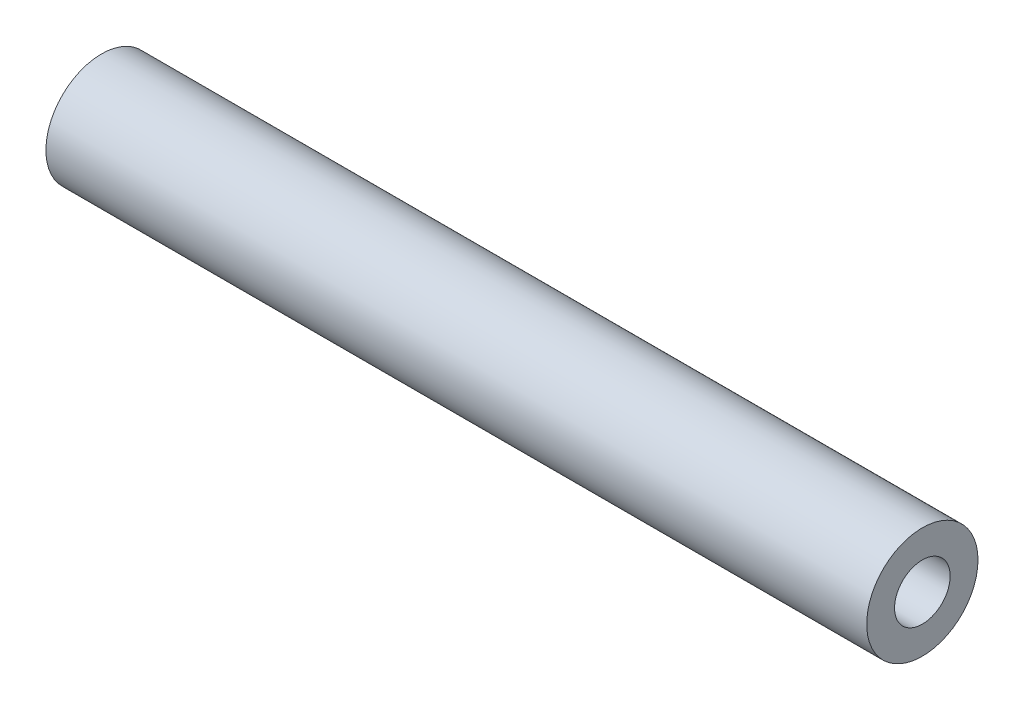
ISO-10303-21;
HEADER;
FILE_DESCRIPTION(('STEP AP214'),'2;1');
FILE_NAME('part.step','',(''),(''),'','','');
FILE_SCHEMA(('AUTOMOTIVE_DESIGN { 1 0 10303 214 1 1 1 1 }'));
ENDSEC;
DATA;
#1=APPLICATION_CONTEXT('core data for automotive mechanical design processes');
#2=APPLICATION_PROTOCOL_DEFINITION('international standard','automotive_design',2000,#1);
#3=PRODUCT_CONTEXT('',#1,'mechanical');
#4=PRODUCT('Part','Part','',(#3));
#5=PRODUCT_RELATED_PRODUCT_CATEGORY('part','',(#4));
#6=PRODUCT_DEFINITION_FORMATION('','',#4);
#7=PRODUCT_DEFINITION_CONTEXT('part definition',#1,'design');
#8=PRODUCT_DEFINITION('design','',#6,#7);
#9=PRODUCT_DEFINITION_SHAPE('','',#8);
#10=(LENGTH_UNIT() NAMED_UNIT(*) SI_UNIT(.MILLI.,.METRE.));
#11=(NAMED_UNIT(*) PLANE_ANGLE_UNIT() SI_UNIT($,.RADIAN.));
#12=(NAMED_UNIT(*) SI_UNIT($,.STERADIAN.) SOLID_ANGLE_UNIT());
#13=UNCERTAINTY_MEASURE_WITH_UNIT(LENGTH_MEASURE(1.E-05),#10,'distance_accuracy_value','');
#14=(GEOMETRIC_REPRESENTATION_CONTEXT(3) GLOBAL_UNCERTAINTY_ASSIGNED_CONTEXT((#13)) GLOBAL_UNIT_ASSIGNED_CONTEXT((#10,
#11,#12)) REPRESENTATION_CONTEXT('',''));
#15=CARTESIAN_POINT('',(0.,0.,0.));
#16=DIRECTION('',(0.,0.,1.));
#17=DIRECTION('',(1.,0.,0.));
#18=AXIS2_PLACEMENT_3D('',#15,#16,#17);
#19=CARTESIAN_POINT('',(93.6625,0.,0.));
#20=DIRECTION('',(1.,0.,0.));
#21=DIRECTION('',(0.,0.,-1.));
#22=AXIS2_PLACEMENT_3D('',#19,#20,#21);
#23=PLANE('',#22);
#24=CARTESIAN_POINT('',(93.6625,0.,0.));
#25=DIRECTION('',(1.,0.,0.));
#26=DIRECTION('',(0.,0.,-1.));
#27=AXIS2_PLACEMENT_3D('',#24,#25,#26);
#28=CIRCLE('',#27,12.7);
#29=CARTESIAN_POINT('',(93.6625,0.,-12.7));
#30=VERTEX_POINT('',#29);
#31=EDGE_CURVE('E10',#30,#30,#28,.T.);
#32=ORIENTED_EDGE('',*,*,#31,.T.);
#33=EDGE_LOOP('',(#32));
#34=FACE_BOUND('',#33,.T.);
#35=CARTESIAN_POINT('',(93.6625,0.,0.));
#36=DIRECTION('',(1.,0.,0.));
#37=DIRECTION('',(0.,0.,-1.));
#38=AXIS2_PLACEMENT_3D('',#35,#36,#37);
#39=CIRCLE('',#38,6.35);
#40=CARTESIAN_POINT('',(93.6625,0.,-6.35));
#41=VERTEX_POINT('',#40);
#42=EDGE_CURVE('E42',#41,#41,#39,.T.);
#43=ORIENTED_EDGE('',*,*,#42,.F.);
#44=EDGE_LOOP('',(#43));
#45=FACE_BOUND('',#44,.T.);
#46=ADVANCED_FACE('F31',(#34,#45),#23,.T.);
#47=CARTESIAN_POINT('',(-93.6625,0.,0.));
#48=DIRECTION('',(1.,0.,0.));
#49=DIRECTION('',(0.,0.,-1.));
#50=AXIS2_PLACEMENT_3D('',#47,#48,#49);
#51=PLANE('',#50);
#52=CARTESIAN_POINT('',(-93.6625,0.,0.));
#53=DIRECTION('',(1.,0.,0.));
#54=DIRECTION('',(0.,0.,-1.));
#55=AXIS2_PLACEMENT_3D('',#52,#53,#54);
#56=CIRCLE('',#55,12.7);
#57=CARTESIAN_POINT('',(-93.6625,0.,-12.7));
#58=VERTEX_POINT('',#57);
#59=EDGE_CURVE('E35',#58,#58,#56,.T.);
#60=ORIENTED_EDGE('',*,*,#59,.F.);
#61=EDGE_LOOP('',(#60));
#62=FACE_BOUND('',#61,.T.);
#63=CARTESIAN_POINT('',(-93.6625,0.,0.));
#64=DIRECTION('',(1.,0.,0.));
#65=DIRECTION('',(0.,0.,-1.));
#66=AXIS2_PLACEMENT_3D('',#63,#64,#65);
#67=CIRCLE('',#66,6.35);
#68=CARTESIAN_POINT('',(-93.6625,0.,-6.35));
#69=VERTEX_POINT('',#68);
#70=EDGE_CURVE('E44',#69,#69,#67,.T.);
#71=ORIENTED_EDGE('',*,*,#70,.T.);
#72=EDGE_LOOP('',(#71));
#73=FACE_BOUND('',#72,.T.);
#74=ADVANCED_FACE('F54',(#62,#73),#51,.F.);
#75=CARTESIAN_POINT('',(93.6625,0.,0.));
#76=DIRECTION('',(-1.,0.,0.));
#77=DIRECTION('',(0.,0.,1.));
#78=AXIS2_PLACEMENT_3D('',#75,#76,#77);
#79=CYLINDRICAL_SURFACE('',#78,12.7);
#80=ORIENTED_EDGE('',*,*,#31,.F.);
#81=EDGE_LOOP('',(#80));
#82=FACE_BOUND('',#81,.T.);
#83=ORIENTED_EDGE('',*,*,#59,.T.);
#84=EDGE_LOOP('',(#83));
#85=FACE_BOUND('',#84,.T.);
#86=ADVANCED_FACE('F33',(#82,#85),#79,.T.);
#87=CARTESIAN_POINT('',(93.6625,0.,0.));
#88=DIRECTION('',(-1.,0.,0.));
#89=DIRECTION('',(0.,0.,1.));
#90=AXIS2_PLACEMENT_3D('',#87,#88,#89);
#91=CYLINDRICAL_SURFACE('',#90,6.35);
#92=ORIENTED_EDGE('',*,*,#42,.T.);
#93=EDGE_LOOP('',(#92));
#94=FACE_BOUND('',#93,.T.);
#95=ORIENTED_EDGE('',*,*,#70,.F.);
#96=EDGE_LOOP('',(#95));
#97=FACE_BOUND('',#96,.T.);
#98=ADVANCED_FACE('F50',(#94,#97),#91,.F.);
#99=CLOSED_SHELL('',(#46,#74,#86,#98));
#100=MANIFOLD_SOLID_BREP('B2',#99);
#101=ADVANCED_BREP_SHAPE_REPRESENTATION('',(#18,#100),#14);
#102=SHAPE_DEFINITION_REPRESENTATION(#9,#101);
ENDSEC;
END-ISO-10303-21;
